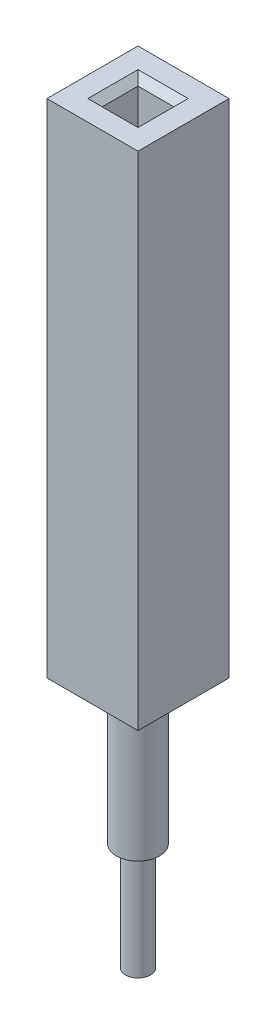
ISO-10303-21;
HEADER;
FILE_DESCRIPTION(('STEP AP214'),'2;1');
FILE_NAME('part.step','',(''),(''),'','','');
FILE_SCHEMA(('AUTOMOTIVE_DESIGN { 1 0 10303 214 1 1 1 1 }'));
ENDSEC;
DATA;
#1=APPLICATION_CONTEXT('core data for automotive mechanical design processes');
#2=APPLICATION_PROTOCOL_DEFINITION('international standard','automotive_design',2000,#1);
#3=PRODUCT_CONTEXT('',#1,'mechanical');
#4=PRODUCT('Part','Part','',(#3));
#5=PRODUCT_RELATED_PRODUCT_CATEGORY('part','',(#4));
#6=PRODUCT_DEFINITION_FORMATION('','',#4);
#7=PRODUCT_DEFINITION_CONTEXT('part definition',#1,'design');
#8=PRODUCT_DEFINITION('design','',#6,#7);
#9=PRODUCT_DEFINITION_SHAPE('','',#8);
#10=(LENGTH_UNIT() NAMED_UNIT(*) SI_UNIT(.MILLI.,.METRE.));
#11=(NAMED_UNIT(*) PLANE_ANGLE_UNIT() SI_UNIT($,.RADIAN.));
#12=(NAMED_UNIT(*) SI_UNIT($,.STERADIAN.) SOLID_ANGLE_UNIT());
#13=UNCERTAINTY_MEASURE_WITH_UNIT(LENGTH_MEASURE(1.E-05),#10,'distance_accuracy_value','');
#14=(GEOMETRIC_REPRESENTATION_CONTEXT(3) GLOBAL_UNCERTAINTY_ASSIGNED_CONTEXT((#13)) GLOBAL_UNIT_ASSIGNED_CONTEXT((#10,
#11,#12)) REPRESENTATION_CONTEXT('',''));
#15=CARTESIAN_POINT('',(0.,0.,0.));
#16=DIRECTION('',(0.,0.,1.));
#17=DIRECTION('',(1.,0.,0.));
#18=AXIS2_PLACEMENT_3D('',#15,#16,#17);
#19=CARTESIAN_POINT('',(0.,-7.,0.));
#20=DIRECTION('',(0.,1.,0.));
#21=DIRECTION('',(0.,0.,1.));
#22=AXIS2_PLACEMENT_3D('',#19,#20,#21);
#23=CYLINDRICAL_SURFACE('',#22,0.35);
#24=CARTESIAN_POINT('',(0.,-7.,0.));
#25=DIRECTION('',(0.,-1.,0.));
#26=DIRECTION('',(0.,0.,-1.));
#27=AXIS2_PLACEMENT_3D('',#24,#25,#26);
#28=CIRCLE('',#27,0.35);
#29=CARTESIAN_POINT('',(0.,-7.,-0.35));
#30=VERTEX_POINT('',#29);
#31=EDGE_CURVE('E11',#30,#30,#28,.T.);
#32=ORIENTED_EDGE('',*,*,#31,.F.);
#33=EDGE_LOOP('',(#32));
#34=FACE_BOUND('',#33,.T.);
#35=CARTESIAN_POINT('',(0.,-4.,0.));
#36=DIRECTION('',(0.,-1.,0.));
#37=DIRECTION('',(0.,0.,-1.));
#38=AXIS2_PLACEMENT_3D('',#35,#36,#37);
#39=CIRCLE('',#38,0.35);
#40=CARTESIAN_POINT('',(0.,-4.,-0.35));
#41=VERTEX_POINT('',#40);
#42=EDGE_CURVE('E49',#41,#41,#39,.T.);
#43=ORIENTED_EDGE('',*,*,#42,.T.);
#44=EDGE_LOOP('',(#43));
#45=FACE_BOUND('',#44,.T.);
#46=ADVANCED_FACE('F46',(#34,#45),#23,.T.);
#47=CARTESIAN_POINT('',(0.,-7.,0.));
#48=DIRECTION('',(0.,-1.,0.));
#49=DIRECTION('',(0.,0.,-1.));
#50=AXIS2_PLACEMENT_3D('',#47,#48,#49);
#51=PLANE('',#50);
#52=ORIENTED_EDGE('',*,*,#31,.T.);
#53=EDGE_LOOP('',(#52));
#54=FACE_BOUND('',#53,.T.);
#55=ADVANCED_FACE('F61',(#54),#51,.T.);
#56=CARTESIAN_POINT('',(0.,-4.,0.));
#57=DIRECTION('',(0.,-1.,0.));
#58=DIRECTION('',(0.,0.,-1.));
#59=AXIS2_PLACEMENT_3D('',#56,#57,#58);
#60=PLANE('',#59);
#61=ORIENTED_EDGE('',*,*,#42,.F.);
#62=EDGE_LOOP('',(#61));
#63=FACE_BOUND('',#62,.T.);
#64=ADVANCED_FACE('F59',(#63),#60,.F.);
#65=CLOSED_SHELL('',(#46,#55,#64));
#66=MANIFOLD_SOLID_BREP('B2',#65);
#67=CARTESIAN_POINT('',(0.,-4.,0.));
#68=DIRECTION('',(0.,1.,0.));
#69=DIRECTION('',(0.,0.,1.));
#70=AXIS2_PLACEMENT_3D('',#67,#68,#69);
#71=CYLINDRICAL_SURFACE('',#70,0.6);
#72=CARTESIAN_POINT('',(0.,-4.,0.));
#73=DIRECTION('',(0.,-1.,0.));
#74=DIRECTION('',(0.,0.,-1.));
#75=AXIS2_PLACEMENT_3D('',#72,#73,#74);
#76=CIRCLE('',#75,0.6);
#77=CARTESIAN_POINT('',(0.,-4.,-0.6));
#78=VERTEX_POINT('',#77);
#79=EDGE_CURVE('E45',#78,#78,#76,.T.);
#80=ORIENTED_EDGE('',*,*,#79,.F.);
#81=EDGE_LOOP('',(#80));
#82=FACE_BOUND('',#81,.T.);
#83=CARTESIAN_POINT('',(0.,3.,0.));
#84=DIRECTION('',(0.,-1.,0.));
#85=DIRECTION('',(0.,0.,-1.));
#86=AXIS2_PLACEMENT_3D('',#83,#84,#85);
#87=CIRCLE('',#86,0.6);
#88=CARTESIAN_POINT('',(0.,3.,-0.6));
#89=VERTEX_POINT('',#88);
#90=EDGE_CURVE('E99',#89,#89,#87,.T.);
#91=ORIENTED_EDGE('',*,*,#90,.T.);
#92=EDGE_LOOP('',(#91));
#93=FACE_BOUND('',#92,.T.);
#94=ADVANCED_FACE('F96',(#82,#93),#71,.T.);
#95=CARTESIAN_POINT('',(0.,-4.,0.));
#96=DIRECTION('',(0.,-1.,0.));
#97=DIRECTION('',(0.,0.,-1.));
#98=AXIS2_PLACEMENT_3D('',#95,#96,#97);
#99=PLANE('',#98);
#100=ORIENTED_EDGE('',*,*,#79,.T.);
#101=EDGE_LOOP('',(#100));
#102=FACE_BOUND('',#101,.T.);
#103=ADVANCED_FACE('F111',(#102),#99,.T.);
#104=CARTESIAN_POINT('',(0.,3.,0.));
#105=DIRECTION('',(0.,-1.,0.));
#106=DIRECTION('',(0.,0.,-1.));
#107=AXIS2_PLACEMENT_3D('',#104,#105,#106);
#108=PLANE('',#107);
#109=ORIENTED_EDGE('',*,*,#90,.F.);
#110=EDGE_LOOP('',(#109));
#111=FACE_BOUND('',#110,.T.);
#112=ADVANCED_FACE('F109',(#111),#108,.F.);
#113=CLOSED_SHELL('',(#94,#103,#112));
#114=MANIFOLD_SOLID_BREP('B6',#113);
#115=CARTESIAN_POINT('',(0.,14.,0.));
#116=DIRECTION('',(0.,1.,0.));
#117=DIRECTION('',(0.,0.,1.));
#118=AXIS2_PLACEMENT_3D('',#115,#116,#117);
#119=PLANE('',#118);
#120=DIRECTION('',(0.,0.,1.));
#121=VECTOR('',#120,1.);
#122=CARTESIAN_POINT('',(0.699999999999997,14.,0.));
#123=LINE('',#122,#121);
#124=CARTESIAN_POINT('',(0.699999999999997,14.,-0.699999999999996));
#125=VERTEX_POINT('',#124);
#126=CARTESIAN_POINT('',(0.699999999999997,14.,0.699999999999998));
#127=VERTEX_POINT('',#126);
#128=EDGE_CURVE('E279',#125,#127,#123,.T.);
#129=ORIENTED_EDGE('',*,*,#128,.T.);
#130=DIRECTION('',(-1.,0.,0.));
#131=VECTOR('',#130,1.);
#132=CARTESIAN_POINT('',(0.,14.,0.699999999999998));
#133=LINE('',#132,#131);
#134=CARTESIAN_POINT('',(-0.699999999999997,14.,0.699999999999998));
#135=VERTEX_POINT('',#134);
#136=EDGE_CURVE('E281',#127,#135,#133,.T.);
#137=ORIENTED_EDGE('',*,*,#136,.T.);
#138=DIRECTION('',(0.,0.,-1.));
#139=VECTOR('',#138,1.);
#140=CARTESIAN_POINT('',(-0.699999999999997,14.,0.));
#141=LINE('',#140,#139);
#142=CARTESIAN_POINT('',(-0.699999999999997,14.,-0.699999999999996));
#143=VERTEX_POINT('',#142);
#144=EDGE_CURVE('E275',#135,#143,#141,.T.);
#145=ORIENTED_EDGE('',*,*,#144,.T.);
#146=DIRECTION('',(1.,0.,0.));
#147=VECTOR('',#146,1.);
#148=CARTESIAN_POINT('',(0.,14.,-0.699999999999996));
#149=LINE('',#148,#147);
#150=EDGE_CURVE('E277',#143,#125,#149,.T.);
#151=ORIENTED_EDGE('',*,*,#150,.T.);
#152=EDGE_LOOP('',(#129,#137,#145,#151));
#153=FACE_BOUND('',#152,.T.);
#154=DIRECTION('',(0.,0.,-1.));
#155=VECTOR('',#154,1.);
#156=CARTESIAN_POINT('',(1.27,14.,-1.27));
#157=LINE('',#156,#155);
#158=CARTESIAN_POINT('',(1.27,14.,1.27));
#159=VERTEX_POINT('',#158);
#160=CARTESIAN_POINT('',(1.27,14.,-1.27));
#161=VERTEX_POINT('',#160);
#162=EDGE_CURVE('E243',#159,#161,#157,.T.);
#163=ORIENTED_EDGE('',*,*,#162,.T.);
#164=DIRECTION('',(-1.,0.,0.));
#165=VECTOR('',#164,1.);
#166=CARTESIAN_POINT('',(-1.27,14.,-1.27));
#167=LINE('',#166,#165);
#168=CARTESIAN_POINT('',(-1.27,14.,-1.27));
#169=VERTEX_POINT('',#168);
#170=EDGE_CURVE('E246',#161,#169,#167,.T.);
#171=ORIENTED_EDGE('',*,*,#170,.T.);
#172=DIRECTION('',(0.,0.,1.));
#173=VECTOR('',#172,1.);
#174=CARTESIAN_POINT('',(-1.27,14.,-1.27));
#175=LINE('',#174,#173);
#176=CARTESIAN_POINT('',(-1.27,14.,1.27));
#177=VERTEX_POINT('',#176);
#178=EDGE_CURVE('E249',#169,#177,#175,.T.);
#179=ORIENTED_EDGE('',*,*,#178,.T.);
#180=DIRECTION('',(1.,0.,0.));
#181=VECTOR('',#180,1.);
#182=CARTESIAN_POINT('',(-1.27,14.,1.27));
#183=LINE('',#182,#181);
#184=EDGE_CURVE('E251',#177,#159,#183,.T.);
#185=ORIENTED_EDGE('',*,*,#184,.T.);
#186=EDGE_LOOP('',(#163,#171,#179,#185));
#187=FACE_BOUND('',#186,.T.);
#188=ADVANCED_FACE('F136',(#153,#187),#119,.T.);
#189=CARTESIAN_POINT('',(0.,0.,0.));
#190=DIRECTION('',(0.,1.,0.));
#191=DIRECTION('',(0.,0.,1.));
#192=AXIS2_PLACEMENT_3D('',#189,#190,#191);
#193=PLANE('',#192);
#194=DIRECTION('',(0.,0.,-1.));
#195=VECTOR('',#194,1.);
#196=CARTESIAN_POINT('',(1.27,0.,-1.27));
#197=LINE('',#196,#195);
#198=CARTESIAN_POINT('',(1.27,0.,1.27));
#199=VERTEX_POINT('',#198);
#200=CARTESIAN_POINT('',(1.27,0.,-1.27));
#201=VERTEX_POINT('',#200);
#202=EDGE_CURVE('E218',#199,#201,#197,.T.);
#203=ORIENTED_EDGE('',*,*,#202,.F.);
#204=DIRECTION('',(1.,0.,0.));
#205=VECTOR('',#204,1.);
#206=CARTESIAN_POINT('',(-1.27,0.,1.27));
#207=LINE('',#206,#205);
#208=CARTESIAN_POINT('',(-1.27,0.,1.27));
#209=VERTEX_POINT('',#208);
#210=EDGE_CURVE('E247',#209,#199,#207,.T.);
#211=ORIENTED_EDGE('',*,*,#210,.F.);
#212=DIRECTION('',(0.,0.,1.));
#213=VECTOR('',#212,1.);
#214=CARTESIAN_POINT('',(-1.27,0.,-1.27));
#215=LINE('',#214,#213);
#216=CARTESIAN_POINT('',(-1.27,0.,-1.27));
#217=VERTEX_POINT('',#216);
#218=EDGE_CURVE('E258',#217,#209,#215,.T.);
#219=ORIENTED_EDGE('',*,*,#218,.F.);
#220=DIRECTION('',(-1.,0.,0.));
#221=VECTOR('',#220,1.);
#222=CARTESIAN_POINT('',(-1.27,0.,-1.27));
#223=LINE('',#222,#221);
#224=EDGE_CURVE('E256',#201,#217,#223,.T.);
#225=ORIENTED_EDGE('',*,*,#224,.F.);
#226=EDGE_LOOP('',(#203,#211,#219,#225));
#227=FACE_BOUND('',#226,.T.);
#228=DIRECTION('',(0.,0.,-1.));
#229=VECTOR('',#228,1.);
#230=CARTESIAN_POINT('',(0.5,0.,-0.499999999999999));
#231=LINE('',#230,#229);
#232=CARTESIAN_POINT('',(0.5,0.,0.500000000000001));
#233=VERTEX_POINT('',#232);
#234=CARTESIAN_POINT('',(0.5,0.,-0.499999999999999));
#235=VERTEX_POINT('',#234);
#236=EDGE_CURVE('E216',#233,#235,#231,.T.);
#237=ORIENTED_EDGE('',*,*,#236,.T.);
#238=DIRECTION('',(-1.,0.,0.));
#239=VECTOR('',#238,1.);
#240=CARTESIAN_POINT('',(-0.5,0.,-0.499999999999999));
#241=LINE('',#240,#239);
#242=CARTESIAN_POINT('',(-0.5,0.,-0.499999999999999));
#243=VERTEX_POINT('',#242);
#244=EDGE_CURVE('E222',#235,#243,#241,.T.);
#245=ORIENTED_EDGE('',*,*,#244,.T.);
#246=DIRECTION('',(0.,0.,1.));
#247=VECTOR('',#246,1.);
#248=CARTESIAN_POINT('',(-0.5,0.,-0.499999999999999));
#249=LINE('',#248,#247);
#250=CARTESIAN_POINT('',(-0.5,0.,0.500000000000001));
#251=VERTEX_POINT('',#250);
#252=EDGE_CURVE('E227',#243,#251,#249,.T.);
#253=ORIENTED_EDGE('',*,*,#252,.T.);
#254=DIRECTION('',(1.,0.,0.));
#255=VECTOR('',#254,1.);
#256=CARTESIAN_POINT('',(-0.5,0.,0.500000000000001));
#257=LINE('',#256,#255);
#258=EDGE_CURVE('E231',#251,#233,#257,.T.);
#259=ORIENTED_EDGE('',*,*,#258,.T.);
#260=EDGE_LOOP('',(#237,#245,#253,#259));
#261=FACE_BOUND('',#260,.T.);
#262=ADVANCED_FACE('F229',(#227,#261),#193,.F.);
#263=CARTESIAN_POINT('',(1.27,14.,-1.27));
#264=DIRECTION('',(-1.,0.,0.));
#265=DIRECTION('',(0.,0.,1.));
#266=AXIS2_PLACEMENT_3D('',#263,#264,#265);
#267=PLANE('',#266);
#268=ORIENTED_EDGE('',*,*,#202,.T.);
#269=DIRECTION('',(0.,-1.,0.));
#270=VECTOR('',#269,1.);
#271=CARTESIAN_POINT('',(1.27,14.,-1.27));
#272=LINE('',#271,#270);
#273=EDGE_CURVE('E269',#161,#201,#272,.T.);
#274=ORIENTED_EDGE('',*,*,#273,.F.);
#275=ORIENTED_EDGE('',*,*,#162,.F.);
#276=DIRECTION('',(0.,-1.,0.));
#277=VECTOR('',#276,1.);
#278=CARTESIAN_POINT('',(1.27,14.,1.27));
#279=LINE('',#278,#277);
#280=EDGE_CURVE('E253',#159,#199,#279,.T.);
#281=ORIENTED_EDGE('',*,*,#280,.T.);
#282=EDGE_LOOP('',(#268,#274,#275,#281));
#283=FACE_BOUND('',#282,.T.);
#284=ADVANCED_FACE('F322',(#283),#267,.F.);
#285=CARTESIAN_POINT('',(-1.27,14.,-1.27));
#286=DIRECTION('',(0.,0.,1.));
#287=DIRECTION('',(1.,0.,0.));
#288=AXIS2_PLACEMENT_3D('',#285,#286,#287);
#289=PLANE('',#288);
#290=ORIENTED_EDGE('',*,*,#224,.T.);
#291=DIRECTION('',(0.,-1.,0.));
#292=VECTOR('',#291,1.);
#293=CARTESIAN_POINT('',(-1.27,14.,-1.27));
#294=LINE('',#293,#292);
#295=EDGE_CURVE('E266',#169,#217,#294,.T.);
#296=ORIENTED_EDGE('',*,*,#295,.F.);
#297=ORIENTED_EDGE('',*,*,#170,.F.);
#298=ORIENTED_EDGE('',*,*,#273,.T.);
#299=EDGE_LOOP('',(#290,#296,#297,#298));
#300=FACE_BOUND('',#299,.T.);
#301=ADVANCED_FACE('F325',(#300),#289,.F.);
#302=CARTESIAN_POINT('',(-1.27,14.,-1.27));
#303=DIRECTION('',(1.,0.,0.));
#304=DIRECTION('',(0.,0.,-1.));
#305=AXIS2_PLACEMENT_3D('',#302,#303,#304);
#306=PLANE('',#305);
#307=ORIENTED_EDGE('',*,*,#218,.T.);
#308=DIRECTION('',(0.,-1.,0.));
#309=VECTOR('',#308,1.);
#310=CARTESIAN_POINT('',(-1.27,14.,1.27));
#311=LINE('',#310,#309);
#312=EDGE_CURVE('E263',#177,#209,#311,.T.);
#313=ORIENTED_EDGE('',*,*,#312,.F.);
#314=ORIENTED_EDGE('',*,*,#178,.F.);
#315=ORIENTED_EDGE('',*,*,#295,.T.);
#316=EDGE_LOOP('',(#307,#313,#314,#315));
#317=FACE_BOUND('',#316,.T.);
#318=ADVANCED_FACE('F330',(#317),#306,.F.);
#319=CARTESIAN_POINT('',(-1.27,14.,1.27));
#320=DIRECTION('',(0.,0.,-1.));
#321=DIRECTION('',(-1.,0.,0.));
#322=AXIS2_PLACEMENT_3D('',#319,#320,#321);
#323=PLANE('',#322);
#324=ORIENTED_EDGE('',*,*,#210,.T.);
#325=ORIENTED_EDGE('',*,*,#280,.F.);
#326=ORIENTED_EDGE('',*,*,#184,.F.);
#327=ORIENTED_EDGE('',*,*,#312,.T.);
#328=EDGE_LOOP('',(#324,#325,#326,#327));
#329=FACE_BOUND('',#328,.T.);
#330=ADVANCED_FACE('F333',(#329),#323,.F.);
#331=CARTESIAN_POINT('',(0.5,14.,-0.499999999999999));
#332=DIRECTION('',(-1.,0.,0.));
#333=DIRECTION('',(0.,0.,1.));
#334=AXIS2_PLACEMENT_3D('',#331,#332,#333);
#335=PLANE('',#334);
#336=DIRECTION('',(0.,-1.,0.));
#337=VECTOR('',#336,1.);
#338=CARTESIAN_POINT('',(0.5,14.,0.500000000000001));
#339=LINE('',#338,#337);
#340=CARTESIAN_POINT('',(0.5,13.8,0.500000000000001));
#341=VERTEX_POINT('',#340);
#342=EDGE_CURVE('E238',#341,#233,#339,.T.);
#343=ORIENTED_EDGE('',*,*,#342,.F.);
#344=DIRECTION('',(0.,0.,-1.));
#345=VECTOR('',#344,1.);
#346=CARTESIAN_POINT('',(0.5,13.8,-0.499999999999999));
#347=LINE('',#346,#345);
#348=CARTESIAN_POINT('',(0.5,13.8,-0.499999999999999));
#349=VERTEX_POINT('',#348);
#350=EDGE_CURVE('E160',#341,#349,#347,.T.);
#351=ORIENTED_EDGE('',*,*,#350,.T.);
#352=DIRECTION('',(0.,-1.,0.));
#353=VECTOR('',#352,1.);
#354=CARTESIAN_POINT('',(0.5,14.,-0.499999999999999));
#355=LINE('',#354,#353);
#356=EDGE_CURVE('E212',#349,#235,#355,.T.);
#357=ORIENTED_EDGE('',*,*,#356,.T.);
#358=ORIENTED_EDGE('',*,*,#236,.F.);
#359=EDGE_LOOP('',(#343,#351,#357,#358));
#360=FACE_BOUND('',#359,.T.);
#361=ADVANCED_FACE('F214',(#360),#335,.T.);
#362=CARTESIAN_POINT('',(-0.5,14.,-0.499999999999999));
#363=DIRECTION('',(0.,0.,1.));
#364=DIRECTION('',(1.,0.,0.));
#365=AXIS2_PLACEMENT_3D('',#362,#363,#364);
#366=PLANE('',#365);
#367=ORIENTED_EDGE('',*,*,#356,.F.);
#368=DIRECTION('',(-1.,0.,0.));
#369=VECTOR('',#368,1.);
#370=CARTESIAN_POINT('',(-0.5,13.8,-0.499999999999999));
#371=LINE('',#370,#369);
#372=CARTESIAN_POINT('',(-0.5,13.8,-0.499999999999999));
#373=VERTEX_POINT('',#372);
#374=EDGE_CURVE('E145',#349,#373,#371,.T.);
#375=ORIENTED_EDGE('',*,*,#374,.T.);
#376=DIRECTION('',(0.,-1.,0.));
#377=VECTOR('',#376,1.);
#378=CARTESIAN_POINT('',(-0.5,14.,-0.499999999999999));
#379=LINE('',#378,#377);
#380=EDGE_CURVE('E219',#373,#243,#379,.T.);
#381=ORIENTED_EDGE('',*,*,#380,.T.);
#382=ORIENTED_EDGE('',*,*,#244,.F.);
#383=EDGE_LOOP('',(#367,#375,#381,#382));
#384=FACE_BOUND('',#383,.T.);
#385=ADVANCED_FACE('F223',(#384),#366,.T.);
#386=CARTESIAN_POINT('',(-0.5,14.,-0.499999999999999));
#387=DIRECTION('',(1.,0.,0.));
#388=DIRECTION('',(0.,0.,-1.));
#389=AXIS2_PLACEMENT_3D('',#386,#387,#388);
#390=PLANE('',#389);
#391=ORIENTED_EDGE('',*,*,#380,.F.);
#392=DIRECTION('',(0.,0.,1.));
#393=VECTOR('',#392,1.);
#394=CARTESIAN_POINT('',(-0.5,13.8,-0.499999999999999));
#395=LINE('',#394,#393);
#396=CARTESIAN_POINT('',(-0.5,13.8,0.500000000000001));
#397=VERTEX_POINT('',#396);
#398=EDGE_CURVE('E94',#373,#397,#395,.T.);
#399=ORIENTED_EDGE('',*,*,#398,.T.);
#400=DIRECTION('',(0.,-1.,0.));
#401=VECTOR('',#400,1.);
#402=CARTESIAN_POINT('',(-0.5,14.,0.500000000000001));
#403=LINE('',#402,#401);
#404=EDGE_CURVE('E240',#397,#251,#403,.T.);
#405=ORIENTED_EDGE('',*,*,#404,.T.);
#406=ORIENTED_EDGE('',*,*,#252,.F.);
#407=EDGE_LOOP('',(#391,#399,#405,#406));
#408=FACE_BOUND('',#407,.T.);
#409=ADVANCED_FACE('F306',(#408),#390,.T.);
#410=CARTESIAN_POINT('',(-0.5,14.,0.500000000000001));
#411=DIRECTION('',(0.,0.,-1.));
#412=DIRECTION('',(-1.,0.,0.));
#413=AXIS2_PLACEMENT_3D('',#410,#411,#412);
#414=PLANE('',#413);
#415=ORIENTED_EDGE('',*,*,#404,.F.);
#416=DIRECTION('',(1.,0.,0.));
#417=VECTOR('',#416,1.);
#418=CARTESIAN_POINT('',(-0.5,13.8,0.500000000000001));
#419=LINE('',#418,#417);
#420=EDGE_CURVE('E272',#397,#341,#419,.T.);
#421=ORIENTED_EDGE('',*,*,#420,.T.);
#422=ORIENTED_EDGE('',*,*,#342,.T.);
#423=ORIENTED_EDGE('',*,*,#258,.F.);
#424=EDGE_LOOP('',(#415,#421,#422,#423));
#425=FACE_BOUND('',#424,.T.);
#426=ADVANCED_FACE('F308',(#425),#414,.T.);
#427=CARTESIAN_POINT('',(-0.5,13.8,-0.499999999999999));
#428=DIRECTION('',(0.,-0.707106781186544,-0.707106781186551));
#429=DIRECTION('',(-1.,0.,0.));
#430=AXIS2_PLACEMENT_3D('',#427,#428,#429);
#431=PLANE('',#430);
#432=DIRECTION('',(0.577350269189624,0.577350269189629,-0.577350269189624));
#433=VECTOR('',#432,1.);
#434=CARTESIAN_POINT('',(0.5,13.8,-0.499999999999999));
#435=LINE('',#434,#433);
#436=EDGE_CURVE('E234',#125,#349,#435,.F.);
#437=ORIENTED_EDGE('',*,*,#436,.F.);
#438=ORIENTED_EDGE('',*,*,#150,.F.);
#439=DIRECTION('',(-0.577350269189624,0.577350269189629,-0.577350269189624));
#440=VECTOR('',#439,1.);
#441=CARTESIAN_POINT('',(-0.5,13.8,-0.499999999999999));
#442=LINE('',#441,#440);
#443=EDGE_CURVE('E140',#373,#143,#442,.T.);
#444=ORIENTED_EDGE('',*,*,#443,.F.);
#445=ORIENTED_EDGE('',*,*,#374,.F.);
#446=EDGE_LOOP('',(#437,#438,#444,#445));
#447=FACE_BOUND('',#446,.T.);
#448=ADVANCED_FACE('F138',(#447),#431,.F.);
#449=CARTESIAN_POINT('',(-0.5,13.8,-0.499999999999999));
#450=DIRECTION('',(-0.707106781186551,-0.707106781186544,0.));
#451=DIRECTION('',(0.,0.,1.));
#452=AXIS2_PLACEMENT_3D('',#449,#450,#451);
#453=PLANE('',#452);
#454=ORIENTED_EDGE('',*,*,#443,.T.);
#455=ORIENTED_EDGE('',*,*,#144,.F.);
#456=DIRECTION('',(0.577350269189624,-0.577350269189629,-0.577350269189624));
#457=VECTOR('',#456,1.);
#458=CARTESIAN_POINT('',(-0.5,13.8,0.500000000000001));
#459=LINE('',#458,#457);
#460=EDGE_CURVE('E288',#397,#135,#459,.F.);
#461=ORIENTED_EDGE('',*,*,#460,.F.);
#462=ORIENTED_EDGE('',*,*,#398,.F.);
#463=EDGE_LOOP('',(#454,#455,#461,#462));
#464=FACE_BOUND('',#463,.T.);
#465=ADVANCED_FACE('F302',(#464),#453,.F.);
#466=CARTESIAN_POINT('',(0.5,13.8,-0.499999999999999));
#467=DIRECTION('',(0.707106781186551,-0.707106781186545,0.));
#468=DIRECTION('',(0.,0.,-1.));
#469=AXIS2_PLACEMENT_3D('',#466,#467,#468);
#470=PLANE('',#469);
#471=ORIENTED_EDGE('',*,*,#436,.T.);
#472=ORIENTED_EDGE('',*,*,#350,.F.);
#473=DIRECTION('',(0.577350269189624,0.577350269189629,0.577350269189624));
#474=VECTOR('',#473,1.);
#475=CARTESIAN_POINT('',(0.166666666666668,13.4666666666667,0.166666666666669));
#476=LINE('',#475,#474);
#477=EDGE_CURVE('E286',#127,#341,#476,.F.);
#478=ORIENTED_EDGE('',*,*,#477,.F.);
#479=ORIENTED_EDGE('',*,*,#128,.F.);
#480=EDGE_LOOP('',(#471,#472,#478,#479));
#481=FACE_BOUND('',#480,.T.);
#482=ADVANCED_FACE('F293',(#481),#470,.F.);
#483=CARTESIAN_POINT('',(-0.5,13.8,0.500000000000001));
#484=DIRECTION('',(0.,-0.707106781186544,0.707106781186551));
#485=DIRECTION('',(1.,0.,0.));
#486=AXIS2_PLACEMENT_3D('',#483,#484,#485);
#487=PLANE('',#486);
#488=ORIENTED_EDGE('',*,*,#460,.T.);
#489=ORIENTED_EDGE('',*,*,#136,.F.);
#490=ORIENTED_EDGE('',*,*,#477,.T.);
#491=ORIENTED_EDGE('',*,*,#420,.F.);
#492=EDGE_LOOP('',(#488,#489,#490,#491));
#493=FACE_BOUND('',#492,.T.);
#494=ADVANCED_FACE('F310',(#493),#487,.F.);
#495=CLOSED_SHELL('',(#188,#262,#284,#301,#318,#330,#361,#385,#409,#426,#448,#465,#482,#494));
#496=MANIFOLD_SOLID_BREP('B40',#495);
#497=ADVANCED_BREP_SHAPE_REPRESENTATION('',(#18,#66,#114,#496),#14);
#498=SHAPE_DEFINITION_REPRESENTATION(#9,#497);
ENDSEC;
END-ISO-10303-21;
